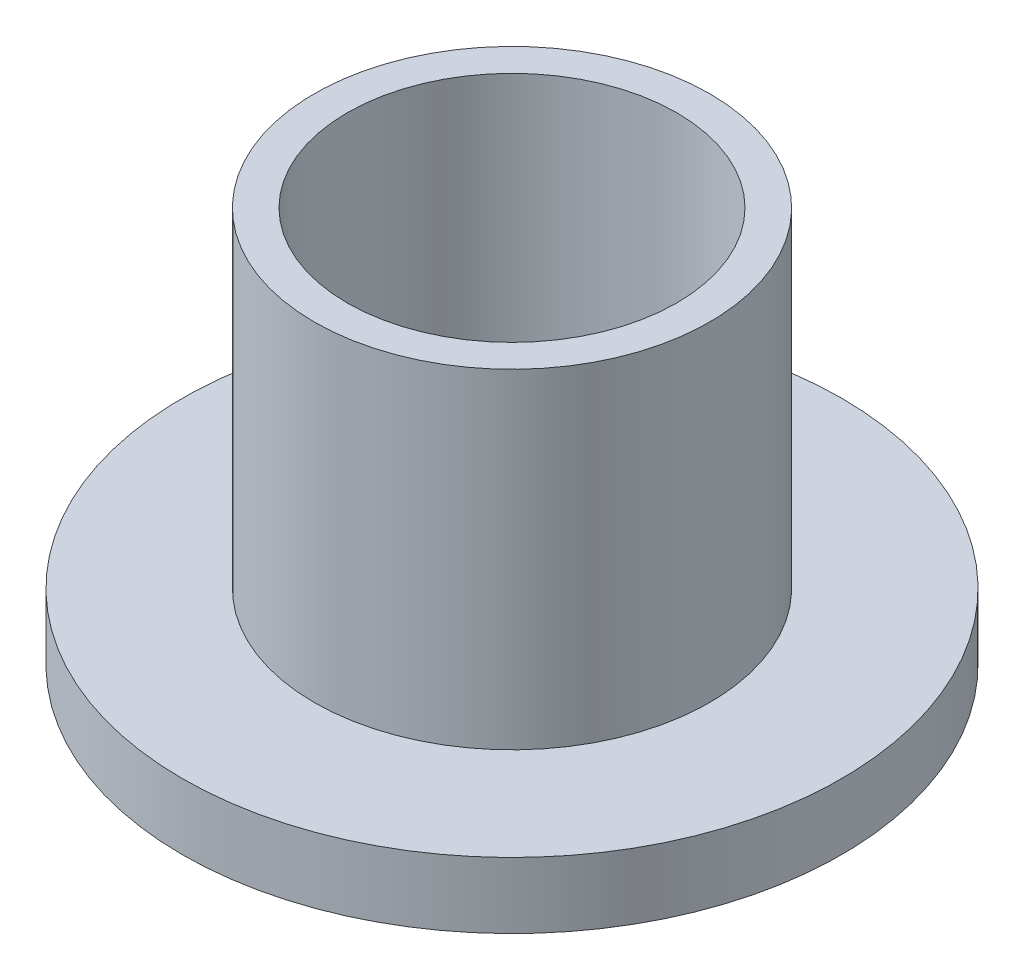
ISO-10303-21;
HEADER;
FILE_DESCRIPTION(('STEP AP214'),'2;1');
FILE_NAME('part.step','',(''),(''),'','','');
FILE_SCHEMA(('AUTOMOTIVE_DESIGN { 1 0 10303 214 1 1 1 1 }'));
ENDSEC;
DATA;
#1=APPLICATION_CONTEXT('core data for automotive mechanical design processes');
#2=APPLICATION_PROTOCOL_DEFINITION('international standard','automotive_design',2000,#1);
#3=PRODUCT_CONTEXT('',#1,'mechanical');
#4=PRODUCT('Part','Part','',(#3));
#5=PRODUCT_RELATED_PRODUCT_CATEGORY('part','',(#4));
#6=PRODUCT_DEFINITION_FORMATION('','',#4);
#7=PRODUCT_DEFINITION_CONTEXT('part definition',#1,'design');
#8=PRODUCT_DEFINITION('design','',#6,#7);
#9=PRODUCT_DEFINITION_SHAPE('','',#8);
#10=(LENGTH_UNIT() NAMED_UNIT(*) SI_UNIT(.MILLI.,.METRE.));
#11=(NAMED_UNIT(*) PLANE_ANGLE_UNIT() SI_UNIT($,.RADIAN.));
#12=(NAMED_UNIT(*) SI_UNIT($,.STERADIAN.) SOLID_ANGLE_UNIT());
#13=UNCERTAINTY_MEASURE_WITH_UNIT(LENGTH_MEASURE(1.E-05),#10,'distance_accuracy_value','');
#14=(GEOMETRIC_REPRESENTATION_CONTEXT(3) GLOBAL_UNCERTAINTY_ASSIGNED_CONTEXT((#13)) GLOBAL_UNIT_ASSIGNED_CONTEXT((#10,
#11,#12)) REPRESENTATION_CONTEXT('',''));
#15=CARTESIAN_POINT('',(0.,0.,0.));
#16=DIRECTION('',(0.,0.,1.));
#17=DIRECTION('',(1.,0.,0.));
#18=AXIS2_PLACEMENT_3D('',#15,#16,#17);
#19=CARTESIAN_POINT('',(0.,2.,0.));
#20=DIRECTION('',(0.,-1.,0.));
#21=DIRECTION('',(0.,0.,-1.));
#22=AXIS2_PLACEMENT_3D('',#19,#20,#21);
#23=CYLINDRICAL_SURFACE('',#22,10.);
#24=CARTESIAN_POINT('',(0.,2.,0.));
#25=DIRECTION('',(0.,1.,0.));
#26=DIRECTION('',(0.,0.,1.));
#27=AXIS2_PLACEMENT_3D('',#24,#25,#26);
#28=CIRCLE('',#27,10.);
#29=CARTESIAN_POINT('',(0.,2.,10.));
#30=VERTEX_POINT('',#29);
#31=EDGE_CURVE('E44',#30,#30,#28,.T.);
#32=ORIENTED_EDGE('',*,*,#31,.F.);
#33=EDGE_LOOP('',(#32));
#34=FACE_BOUND('',#33,.T.);
#35=CARTESIAN_POINT('',(0.,0.,0.));
#36=DIRECTION('',(0.,1.,0.));
#37=DIRECTION('',(0.,0.,1.));
#38=AXIS2_PLACEMENT_3D('',#35,#36,#37);
#39=CIRCLE('',#38,10.);
#40=CARTESIAN_POINT('',(0.,0.,10.));
#41=VERTEX_POINT('',#40);
#42=EDGE_CURVE('E39',#41,#41,#39,.T.);
#43=ORIENTED_EDGE('',*,*,#42,.T.);
#44=EDGE_LOOP('',(#43));
#45=FACE_BOUND('',#44,.T.);
#46=ADVANCED_FACE('F36',(#34,#45),#23,.T.);
#47=CARTESIAN_POINT('',(0.,2.,0.));
#48=DIRECTION('',(0.,1.,0.));
#49=DIRECTION('',(0.,0.,1.));
#50=AXIS2_PLACEMENT_3D('',#47,#48,#49);
#51=PLANE('',#50);
#52=CARTESIAN_POINT('',(0.,2.,0.));
#53=DIRECTION('',(0.,1.,0.));
#54=DIRECTION('',(0.,0.,1.));
#55=AXIS2_PLACEMENT_3D('',#52,#53,#54);
#56=CIRCLE('',#55,6.);
#57=CARTESIAN_POINT('',(0.,2.,6.));
#58=VERTEX_POINT('',#57);
#59=EDGE_CURVE('E10',#58,#58,#56,.T.);
#60=ORIENTED_EDGE('',*,*,#59,.F.);
#61=EDGE_LOOP('',(#60));
#62=FACE_BOUND('',#61,.T.);
#63=ORIENTED_EDGE('',*,*,#31,.T.);
#64=EDGE_LOOP('',(#63));
#65=FACE_BOUND('',#64,.T.);
#66=ADVANCED_FACE('F82',(#62,#65),#51,.T.);
#67=CARTESIAN_POINT('',(0.,0.,0.));
#68=DIRECTION('',(0.,1.,0.));
#69=DIRECTION('',(0.,0.,1.));
#70=AXIS2_PLACEMENT_3D('',#67,#68,#69);
#71=PLANE('',#70);
#72=CARTESIAN_POINT('',(0.,0.,0.));
#73=DIRECTION('',(0.,1.,0.));
#74=DIRECTION('',(0.,0.,1.));
#75=AXIS2_PLACEMENT_3D('',#72,#73,#74);
#76=CIRCLE('',#75,5.);
#77=CARTESIAN_POINT('',(0.,0.,5.));
#78=VERTEX_POINT('',#77);
#79=EDGE_CURVE('E56',#78,#78,#76,.T.);
#80=ORIENTED_EDGE('',*,*,#79,.T.);
#81=EDGE_LOOP('',(#80));
#82=FACE_BOUND('',#81,.T.);
#83=ORIENTED_EDGE('',*,*,#42,.F.);
#84=EDGE_LOOP('',(#83));
#85=FACE_BOUND('',#84,.T.);
#86=ADVANCED_FACE('F77',(#82,#85),#71,.F.);
#87=CARTESIAN_POINT('',(0.,12.,0.));
#88=DIRECTION('',(0.,-1.,0.));
#89=DIRECTION('',(0.,0.,-1.));
#90=AXIS2_PLACEMENT_3D('',#87,#88,#89);
#91=CYLINDRICAL_SURFACE('',#90,6.);
#92=CARTESIAN_POINT('',(0.,12.,0.));
#93=DIRECTION('',(0.,1.,0.));
#94=DIRECTION('',(0.,0.,1.));
#95=AXIS2_PLACEMENT_3D('',#92,#93,#94);
#96=CIRCLE('',#95,6.);
#97=CARTESIAN_POINT('',(0.,12.,6.));
#98=VERTEX_POINT('',#97);
#99=EDGE_CURVE('E52',#98,#98,#96,.T.);
#100=ORIENTED_EDGE('',*,*,#99,.F.);
#101=EDGE_LOOP('',(#100));
#102=FACE_BOUND('',#101,.T.);
#103=ORIENTED_EDGE('',*,*,#59,.T.);
#104=EDGE_LOOP('',(#103));
#105=FACE_BOUND('',#104,.T.);
#106=ADVANCED_FACE('F72',(#102,#105),#91,.T.);
#107=CARTESIAN_POINT('',(0.,12.,0.));
#108=DIRECTION('',(0.,1.,0.));
#109=DIRECTION('',(0.,0.,1.));
#110=AXIS2_PLACEMENT_3D('',#107,#108,#109);
#111=PLANE('',#110);
#112=CARTESIAN_POINT('',(0.,12.,0.));
#113=DIRECTION('',(0.,1.,0.));
#114=DIRECTION('',(0.,0.,1.));
#115=AXIS2_PLACEMENT_3D('',#112,#113,#114);
#116=CIRCLE('',#115,5.);
#117=CARTESIAN_POINT('',(0.,12.,5.));
#118=VERTEX_POINT('',#117);
#119=EDGE_CURVE('E60',#118,#118,#116,.T.);
#120=ORIENTED_EDGE('',*,*,#119,.F.);
#121=EDGE_LOOP('',(#120));
#122=FACE_BOUND('',#121,.T.);
#123=ORIENTED_EDGE('',*,*,#99,.T.);
#124=EDGE_LOOP('',(#123));
#125=FACE_BOUND('',#124,.T.);
#126=ADVANCED_FACE('F69',(#122,#125),#111,.T.);
#127=CARTESIAN_POINT('',(0.,-15.,0.));
#128=DIRECTION('',(0.,1.,0.));
#129=DIRECTION('',(0.,0.,1.));
#130=AXIS2_PLACEMENT_3D('',#127,#128,#129);
#131=CYLINDRICAL_SURFACE('',#130,5.);
#132=ORIENTED_EDGE('',*,*,#119,.T.);
#133=EDGE_LOOP('',(#132));
#134=FACE_BOUND('',#133,.T.);
#135=ORIENTED_EDGE('',*,*,#79,.F.);
#136=EDGE_LOOP('',(#135));
#137=FACE_BOUND('',#136,.T.);
#138=ADVANCED_FACE('F66',(#134,#137),#131,.F.);
#139=CLOSED_SHELL('',(#46,#66,#86,#106,#126,#138));
#140=MANIFOLD_SOLID_BREP('B2',#139);
#141=ADVANCED_BREP_SHAPE_REPRESENTATION('',(#18,#140),#14);
#142=SHAPE_DEFINITION_REPRESENTATION(#9,#141);
ENDSEC;
END-ISO-10303-21;
